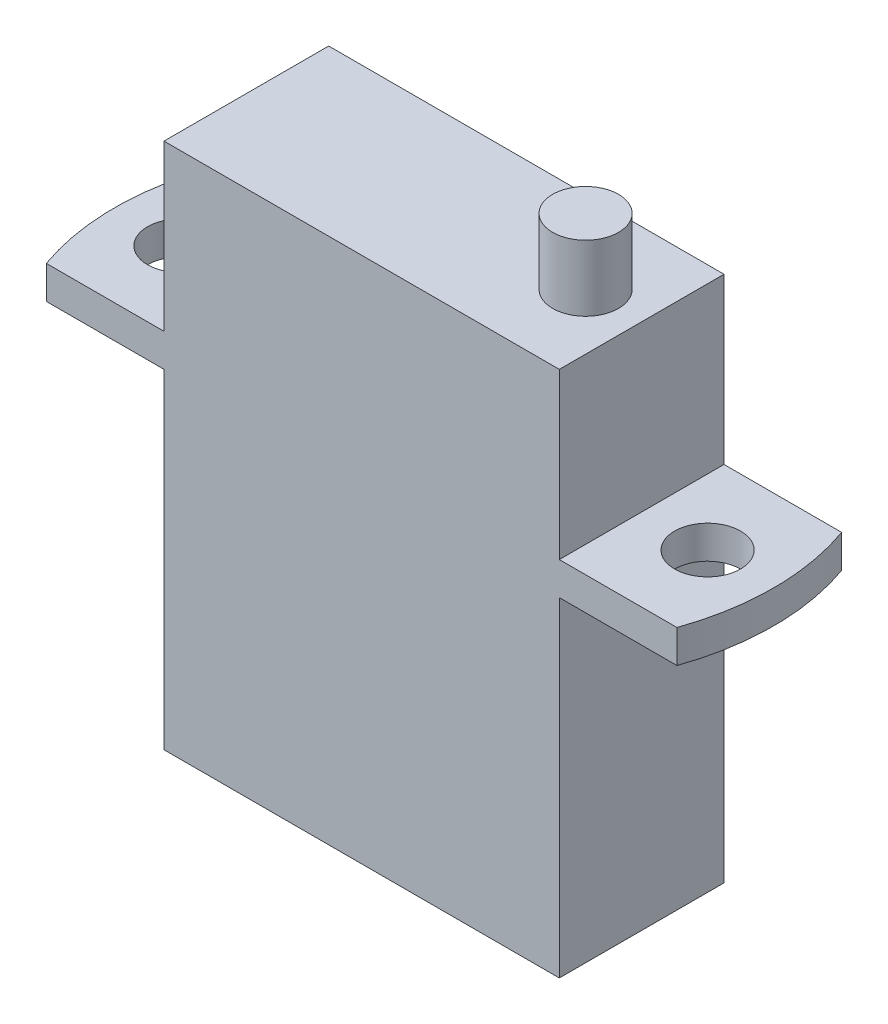
ISO-10303-21;
HEADER;
FILE_DESCRIPTION(('STEP AP214'),'2;1');
FILE_NAME('part.step','',(''),(''),'','','');
FILE_SCHEMA(('AUTOMOTIVE_DESIGN { 1 0 10303 214 1 1 1 1 }'));
ENDSEC;
DATA;
#1=APPLICATION_CONTEXT('core data for automotive mechanical design processes');
#2=APPLICATION_PROTOCOL_DEFINITION('international standard','automotive_design',2000,#1);
#3=PRODUCT_CONTEXT('',#1,'mechanical');
#4=PRODUCT('Part','Part','',(#3));
#5=PRODUCT_RELATED_PRODUCT_CATEGORY('part','',(#4));
#6=PRODUCT_DEFINITION_FORMATION('','',#4);
#7=PRODUCT_DEFINITION_CONTEXT('part definition',#1,'design');
#8=PRODUCT_DEFINITION('design','',#6,#7);
#9=PRODUCT_DEFINITION_SHAPE('','',#8);
#10=(LENGTH_UNIT() NAMED_UNIT(*) SI_UNIT(.MILLI.,.METRE.));
#11=(NAMED_UNIT(*) PLANE_ANGLE_UNIT() SI_UNIT($,.RADIAN.));
#12=(NAMED_UNIT(*) SI_UNIT($,.STERADIAN.) SOLID_ANGLE_UNIT());
#13=UNCERTAINTY_MEASURE_WITH_UNIT(LENGTH_MEASURE(1.E-05),#10,'distance_accuracy_value','');
#14=(GEOMETRIC_REPRESENTATION_CONTEXT(3) GLOBAL_UNCERTAINTY_ASSIGNED_CONTEXT((#13)) GLOBAL_UNIT_ASSIGNED_CONTEXT((#10,
#11,#12)) REPRESENTATION_CONTEXT('',''));
#15=CARTESIAN_POINT('',(0.,0.,0.));
#16=DIRECTION('',(0.,0.,1.));
#17=DIRECTION('',(1.,0.,0.));
#18=AXIS2_PLACEMENT_3D('',#15,#16,#17);
#19=CARTESIAN_POINT('',(0.,6.,0.));
#20=DIRECTION('',(0.,1.,0.));
#21=DIRECTION('',(0.,0.,1.));
#22=AXIS2_PLACEMENT_3D('',#19,#20,#21);
#23=PLANE('',#22);
#24=DIRECTION('',(1.,0.,0.));
#25=VECTOR('',#24,1.);
#26=CARTESIAN_POINT('',(-6.,6.,2.5));
#27=LINE('',#26,#25);
#28=CARTESIAN_POINT('',(-6.,6.,2.5));
#29=VERTEX_POINT('',#28);
#30=CARTESIAN_POINT('',(6.,6.,2.5));
#31=VERTEX_POINT('',#30);
#32=EDGE_CURVE('E136',#29,#31,#27,.T.);
#33=ORIENTED_EDGE('',*,*,#32,.T.);
#34=DIRECTION('',(0.,0.,-1.));
#35=VECTOR('',#34,1.);
#36=CARTESIAN_POINT('',(6.,6.,2.5));
#37=LINE('',#36,#35);
#38=CARTESIAN_POINT('',(6.,6.,-2.5));
#39=VERTEX_POINT('',#38);
#40=EDGE_CURVE('E126',#31,#39,#37,.T.);
#41=ORIENTED_EDGE('',*,*,#40,.T.);
#42=DIRECTION('',(-1.,0.,0.));
#43=VECTOR('',#42,1.);
#44=CARTESIAN_POINT('',(6.,6.,-2.5));
#45=LINE('',#44,#43);
#46=CARTESIAN_POINT('',(-6.,6.,-2.5));
#47=VERTEX_POINT('',#46);
#48=EDGE_CURVE('E135',#39,#47,#45,.T.);
#49=ORIENTED_EDGE('',*,*,#48,.T.);
#50=DIRECTION('',(0.,0.,1.));
#51=VECTOR('',#50,1.);
#52=CARTESIAN_POINT('',(-6.,6.,-2.5));
#53=LINE('',#52,#51);
#54=EDGE_CURVE('E141',#47,#29,#53,.T.);
#55=ORIENTED_EDGE('',*,*,#54,.T.);
#56=EDGE_LOOP('',(#33,#41,#49,#55));
#57=FACE_BOUND('',#56,.T.);
#58=CARTESIAN_POINT('',(4.29775761705287,6.,0.));
#59=DIRECTION('',(0.,1.,0.));
#60=DIRECTION('',(0.,0.,1.));
#61=AXIS2_PLACEMENT_3D('',#58,#59,#60);
#62=CIRCLE('',#61,1.);
#63=CARTESIAN_POINT('',(4.29775761705287,6.,1.));
#64=VERTEX_POINT('',#63);
#65=EDGE_CURVE('E509',#64,#64,#62,.T.);
#66=ORIENTED_EDGE('',*,*,#65,.F.);
#67=EDGE_LOOP('',(#66));
#68=FACE_BOUND('',#67,.T.);
#69=ADVANCED_FACE('F35',(#57,#68),#23,.T.);
#70=CARTESIAN_POINT('',(0.,1.,0.));
#71=DIRECTION('',(0.,1.,0.));
#72=DIRECTION('',(0.,0.,1.));
#73=AXIS2_PLACEMENT_3D('',#70,#71,#72);
#74=PLANE('',#73);
#75=DIRECTION('',(0.,0.,1.));
#76=VECTOR('',#75,1.);
#77=CARTESIAN_POINT('',(-6.,1.,-2.5));
#78=LINE('',#77,#76);
#79=CARTESIAN_POINT('',(-6.,1.,-2.5));
#80=VERTEX_POINT('',#79);
#81=CARTESIAN_POINT('',(-6.,1.,2.5));
#82=VERTEX_POINT('',#81);
#83=EDGE_CURVE('E52',#80,#82,#78,.T.);
#84=ORIENTED_EDGE('',*,*,#83,.F.);
#85=DIRECTION('',(1.,0.,0.));
#86=VECTOR('',#85,1.);
#87=CARTESIAN_POINT('',(0.,1.,-2.5));
#88=LINE('',#87,#86);
#89=CARTESIAN_POINT('',(-9.57106775270161,1.,-2.5));
#90=VERTEX_POINT('',#89);
#91=EDGE_CURVE('E261',#90,#80,#88,.T.);
#92=ORIENTED_EDGE('',*,*,#91,.F.);
#93=CARTESIAN_POINT('',(-2.5,1.,1.67340676413864E-07));
#94=DIRECTION('',(0.,1.,0.));
#95=DIRECTION('',(0.,0.,1.));
#96=AXIS2_PLACEMENT_3D('',#93,#94,#95);
#97=CIRCLE('',#96,7.5);
#98=CARTESIAN_POINT('',(-9.57106787102934,1.,2.5));
#99=VERTEX_POINT('',#98);
#100=EDGE_CURVE('E259',#99,#90,#97,.F.);
#101=ORIENTED_EDGE('',*,*,#100,.F.);
#102=DIRECTION('',(1.,0.,0.));
#103=VECTOR('',#102,1.);
#104=CARTESIAN_POINT('',(0.,1.,2.5));
#105=LINE('',#104,#103);
#106=EDGE_CURVE('E182',#99,#82,#105,.T.);
#107=ORIENTED_EDGE('',*,*,#106,.T.);
#108=EDGE_LOOP('',(#84,#92,#101,#107));
#109=FACE_BOUND('',#108,.T.);
#110=CARTESIAN_POINT('',(-8.,1.,5.35490164524363E-07));
#111=DIRECTION('',(0.,1.,0.));
#112=DIRECTION('',(0.,0.,1.));
#113=AXIS2_PLACEMENT_3D('',#110,#111,#112);
#114=CIRCLE('',#113,1.);
#115=CARTESIAN_POINT('',(-8.,1.,1.00000053549016));
#116=VERTEX_POINT('',#115);
#117=EDGE_CURVE('E245',#116,#116,#114,.F.);
#118=ORIENTED_EDGE('',*,*,#117,.T.);
#119=EDGE_LOOP('',(#118));
#120=FACE_BOUND('',#119,.T.);
#121=ADVANCED_FACE('F300',(#109,#120),#74,.T.);
#122=CARTESIAN_POINT('',(-6.,-10.,2.5));
#123=DIRECTION('',(-1.,0.,0.));
#124=DIRECTION('',(0.,0.,1.));
#125=AXIS2_PLACEMENT_3D('',#122,#123,#124);
#126=PLANE('',#125);
#127=DIRECTION('',(0.,0.,1.));
#128=VECTOR('',#127,1.);
#129=CARTESIAN_POINT('',(-6.,0.,2.5));
#130=LINE('',#129,#128);
#131=CARTESIAN_POINT('',(-6.,0.,-2.5));
#132=VERTEX_POINT('',#131);
#133=CARTESIAN_POINT('',(-6.,0.,2.5));
#134=VERTEX_POINT('',#133);
#135=EDGE_CURVE('E186',#132,#134,#130,.T.);
#136=ORIENTED_EDGE('',*,*,#135,.F.);
#137=DIRECTION('',(0.,1.,0.));
#138=VECTOR('',#137,1.);
#139=CARTESIAN_POINT('',(-6.,-10.,-2.5));
#140=LINE('',#139,#138);
#141=CARTESIAN_POINT('',(-6.,-10.,-2.5));
#142=VERTEX_POINT('',#141);
#143=EDGE_CURVE('E11',#142,#132,#140,.T.);
#144=ORIENTED_EDGE('',*,*,#143,.F.);
#145=DIRECTION('',(0.,0.,1.));
#146=VECTOR('',#145,1.);
#147=CARTESIAN_POINT('',(-6.,-10.,2.5));
#148=LINE('',#147,#146);
#149=CARTESIAN_POINT('',(-6.,-10.,2.5));
#150=VERTEX_POINT('',#149);
#151=EDGE_CURVE('E203',#142,#150,#148,.T.);
#152=ORIENTED_EDGE('',*,*,#151,.T.);
#153=DIRECTION('',(0.,1.,0.));
#154=VECTOR('',#153,1.);
#155=CARTESIAN_POINT('',(-6.,-10.,2.5));
#156=LINE('',#155,#154);
#157=EDGE_CURVE('E209',#150,#134,#156,.T.);
#158=ORIENTED_EDGE('',*,*,#157,.T.);
#159=EDGE_LOOP('',(#136,#144,#152,#158));
#160=FACE_BOUND('',#159,.T.);
#161=ADVANCED_FACE('F37',(#160),#126,.T.);
#162=CARTESIAN_POINT('',(6.,-10.,-2.5));
#163=DIRECTION('',(0.,0.,-1.));
#164=DIRECTION('',(-1.,0.,0.));
#165=AXIS2_PLACEMENT_3D('',#162,#163,#164);
#166=PLANE('',#165);
#167=ORIENTED_EDGE('',*,*,#143,.T.);
#168=DIRECTION('',(1.,0.,0.));
#169=VECTOR('',#168,1.);
#170=CARTESIAN_POINT('',(0.,0.,-2.5));
#171=LINE('',#170,#169);
#172=CARTESIAN_POINT('',(-9.57106775270161,0.,-2.5));
#173=VERTEX_POINT('',#172);
#174=EDGE_CURVE('E229',#173,#132,#171,.T.);
#175=ORIENTED_EDGE('',*,*,#174,.F.);
#176=DIRECTION('',(0.,-1.,0.));
#177=VECTOR('',#176,1.);
#178=CARTESIAN_POINT('',(-9.57106775270161,1.,-2.5));
#179=LINE('',#178,#177);
#180=EDGE_CURVE('E244',#90,#173,#179,.T.);
#181=ORIENTED_EDGE('',*,*,#180,.F.);
#182=ORIENTED_EDGE('',*,*,#91,.T.);
#183=DIRECTION('',(0.,-1.,0.));
#184=VECTOR('',#183,1.);
#185=CARTESIAN_POINT('',(-6.,6.,-2.5));
#186=LINE('',#185,#184);
#187=EDGE_CURVE('E154',#47,#80,#186,.T.);
#188=ORIENTED_EDGE('',*,*,#187,.F.);
#189=ORIENTED_EDGE('',*,*,#48,.F.);
#190=DIRECTION('',(0.,-1.,0.));
#191=VECTOR('',#190,1.);
#192=CARTESIAN_POINT('',(6.,6.,-2.5));
#193=LINE('',#192,#191);
#194=CARTESIAN_POINT('',(6.,1.,-2.5));
#195=VERTEX_POINT('',#194);
#196=EDGE_CURVE('E132',#39,#195,#193,.T.);
#197=ORIENTED_EDGE('',*,*,#196,.T.);
#198=CARTESIAN_POINT('',(9.57106775270161,1.,-2.5));
#199=VERTEX_POINT('',#198);
#200=EDGE_CURVE('E265',#195,#199,#88,.T.);
#201=ORIENTED_EDGE('',*,*,#200,.T.);
#202=DIRECTION('',(0.,-1.,0.));
#203=VECTOR('',#202,1.);
#204=CARTESIAN_POINT('',(9.57106775270161,1.,-2.5));
#205=LINE('',#204,#203);
#206=CARTESIAN_POINT('',(9.57106775270161,0.,-2.5));
#207=VERTEX_POINT('',#206);
#208=EDGE_CURVE('E247',#199,#207,#205,.T.);
#209=ORIENTED_EDGE('',*,*,#208,.T.);
#210=CARTESIAN_POINT('',(6.,0.,-2.5));
#211=VERTEX_POINT('',#210);
#212=EDGE_CURVE('E226',#211,#207,#171,.T.);
#213=ORIENTED_EDGE('',*,*,#212,.F.);
#214=DIRECTION('',(0.,1.,0.));
#215=VECTOR('',#214,1.);
#216=CARTESIAN_POINT('',(6.,-10.,-2.5));
#217=LINE('',#216,#215);
#218=CARTESIAN_POINT('',(6.,-10.,-2.5));
#219=VERTEX_POINT('',#218);
#220=EDGE_CURVE('E44',#219,#211,#217,.T.);
#221=ORIENTED_EDGE('',*,*,#220,.F.);
#222=DIRECTION('',(-1.,0.,0.));
#223=VECTOR('',#222,1.);
#224=CARTESIAN_POINT('',(6.,-10.,-2.5));
#225=LINE('',#224,#223);
#226=EDGE_CURVE('E197',#219,#142,#225,.T.);
#227=ORIENTED_EDGE('',*,*,#226,.T.);
#228=EDGE_LOOP('',(#167,#175,#181,#182,#188,#189,#197,#201,#209,#213,#221,#227));
#229=FACE_BOUND('',#228,.T.);
#230=ADVANCED_FACE('F279',(#229),#166,.T.);
#231=CARTESIAN_POINT('',(6.,-10.,2.5));
#232=DIRECTION('',(1.,0.,0.));
#233=DIRECTION('',(0.,0.,-1.));
#234=AXIS2_PLACEMENT_3D('',#231,#232,#233);
#235=PLANE('',#234);
#236=DIRECTION('',(0.,0.,-1.));
#237=VECTOR('',#236,1.);
#238=CARTESIAN_POINT('',(6.,0.,2.5));
#239=LINE('',#238,#237);
#240=CARTESIAN_POINT('',(6.,0.,2.5));
#241=VERTEX_POINT('',#240);
#242=EDGE_CURVE('E190',#241,#211,#239,.T.);
#243=ORIENTED_EDGE('',*,*,#242,.F.);
#244=DIRECTION('',(0.,1.,0.));
#245=VECTOR('',#244,1.);
#246=CARTESIAN_POINT('',(6.,-10.,2.5));
#247=LINE('',#246,#245);
#248=CARTESIAN_POINT('',(6.,-10.,2.5));
#249=VERTEX_POINT('',#248);
#250=EDGE_CURVE('E205',#249,#241,#247,.T.);
#251=ORIENTED_EDGE('',*,*,#250,.F.);
#252=DIRECTION('',(0.,0.,-1.));
#253=VECTOR('',#252,1.);
#254=CARTESIAN_POINT('',(6.,-10.,2.5));
#255=LINE('',#254,#253);
#256=EDGE_CURVE('E215',#249,#219,#255,.T.);
#257=ORIENTED_EDGE('',*,*,#256,.T.);
#258=ORIENTED_EDGE('',*,*,#220,.T.);
#259=EDGE_LOOP('',(#243,#251,#257,#258));
#260=FACE_BOUND('',#259,.T.);
#261=ADVANCED_FACE('F284',(#260),#235,.T.);
#262=CARTESIAN_POINT('',(6.,-10.,2.5));
#263=DIRECTION('',(0.,0.,1.));
#264=DIRECTION('',(1.,0.,0.));
#265=AXIS2_PLACEMENT_3D('',#262,#263,#264);
#266=PLANE('',#265);
#267=ORIENTED_EDGE('',*,*,#250,.T.);
#268=DIRECTION('',(1.,0.,0.));
#269=VECTOR('',#268,1.);
#270=CARTESIAN_POINT('',(0.,0.,2.5));
#271=LINE('',#270,#269);
#272=CARTESIAN_POINT('',(9.57106787102934,0.,2.5));
#273=VERTEX_POINT('',#272);
#274=EDGE_CURVE('E152',#241,#273,#271,.T.);
#275=ORIENTED_EDGE('',*,*,#274,.T.);
#276=DIRECTION('',(0.,-1.,0.));
#277=VECTOR('',#276,1.);
#278=CARTESIAN_POINT('',(9.57106787102934,1.,2.5));
#279=LINE('',#278,#277);
#280=CARTESIAN_POINT('',(9.57106787102934,1.,2.5));
#281=VERTEX_POINT('',#280);
#282=EDGE_CURVE('E191',#281,#273,#279,.T.);
#283=ORIENTED_EDGE('',*,*,#282,.F.);
#284=CARTESIAN_POINT('',(6.,1.,2.5));
#285=VERTEX_POINT('',#284);
#286=EDGE_CURVE('E148',#285,#281,#105,.T.);
#287=ORIENTED_EDGE('',*,*,#286,.F.);
#288=DIRECTION('',(0.,-1.,0.));
#289=VECTOR('',#288,1.);
#290=CARTESIAN_POINT('',(6.,6.,2.5));
#291=LINE('',#290,#289);
#292=EDGE_CURVE('E130',#31,#285,#291,.T.);
#293=ORIENTED_EDGE('',*,*,#292,.F.);
#294=ORIENTED_EDGE('',*,*,#32,.F.);
#295=DIRECTION('',(0.,-1.,0.));
#296=VECTOR('',#295,1.);
#297=CARTESIAN_POINT('',(-6.,6.,2.5));
#298=LINE('',#297,#296);
#299=EDGE_CURVE('E163',#29,#82,#298,.T.);
#300=ORIENTED_EDGE('',*,*,#299,.T.);
#301=ORIENTED_EDGE('',*,*,#106,.F.);
#302=DIRECTION('',(0.,-1.,0.));
#303=VECTOR('',#302,1.);
#304=CARTESIAN_POINT('',(-9.57106787102934,1.,2.5));
#305=LINE('',#304,#303);
#306=CARTESIAN_POINT('',(-9.57106787102934,0.,2.5));
#307=VERTEX_POINT('',#306);
#308=EDGE_CURVE('E242',#99,#307,#305,.T.);
#309=ORIENTED_EDGE('',*,*,#308,.T.);
#310=EDGE_CURVE('E252',#307,#134,#271,.T.);
#311=ORIENTED_EDGE('',*,*,#310,.T.);
#312=ORIENTED_EDGE('',*,*,#157,.F.);
#313=DIRECTION('',(1.,0.,0.));
#314=VECTOR('',#313,1.);
#315=CARTESIAN_POINT('',(6.,-10.,2.5));
#316=LINE('',#315,#314);
#317=EDGE_CURVE('E219',#150,#249,#316,.T.);
#318=ORIENTED_EDGE('',*,*,#317,.T.);
#319=EDGE_LOOP('',(#267,#275,#283,#287,#293,#294,#300,#301,#309,#311,#312,#318));
#320=FACE_BOUND('',#319,.T.);
#321=ADVANCED_FACE('F146',(#320),#266,.T.);
#322=CARTESIAN_POINT('',(0.,-10.,0.));
#323=DIRECTION('',(0.,1.,0.));
#324=DIRECTION('',(0.,0.,1.));
#325=AXIS2_PLACEMENT_3D('',#322,#323,#324);
#326=PLANE('',#325);
#327=ORIENTED_EDGE('',*,*,#151,.F.);
#328=ORIENTED_EDGE('',*,*,#226,.F.);
#329=ORIENTED_EDGE('',*,*,#256,.F.);
#330=ORIENTED_EDGE('',*,*,#317,.F.);
#331=EDGE_LOOP('',(#327,#328,#329,#330));
#332=FACE_BOUND('',#331,.T.);
#333=ADVANCED_FACE('F288',(#332),#326,.F.);
#334=CARTESIAN_POINT('',(0.,0.,0.));
#335=DIRECTION('',(0.,1.,0.));
#336=DIRECTION('',(0.,0.,1.));
#337=AXIS2_PLACEMENT_3D('',#334,#335,#336);
#338=PLANE('',#337);
#339=CARTESIAN_POINT('',(-8.,0.,5.35490164524363E-07));
#340=DIRECTION('',(0.,1.,0.));
#341=DIRECTION('',(0.,0.,1.));
#342=AXIS2_PLACEMENT_3D('',#339,#340,#341);
#343=CIRCLE('',#342,1.);
#344=CARTESIAN_POINT('',(-8.,0.,1.00000053549016));
#345=VERTEX_POINT('',#344);
#346=EDGE_CURVE('E173',#345,#345,#343,.F.);
#347=ORIENTED_EDGE('',*,*,#346,.F.);
#348=EDGE_LOOP('',(#347));
#349=FACE_BOUND('',#348,.T.);
#350=ORIENTED_EDGE('',*,*,#174,.T.);
#351=ORIENTED_EDGE('',*,*,#135,.T.);
#352=ORIENTED_EDGE('',*,*,#310,.F.);
#353=CARTESIAN_POINT('',(-2.5,0.,1.67340676413864E-07));
#354=DIRECTION('',(0.,1.,0.));
#355=DIRECTION('',(0.,0.,1.));
#356=AXIS2_PLACEMENT_3D('',#353,#354,#355);
#357=CIRCLE('',#356,7.5);
#358=EDGE_CURVE('E236',#307,#173,#357,.F.);
#359=ORIENTED_EDGE('',*,*,#358,.T.);
#360=EDGE_LOOP('',(#350,#351,#352,#359));
#361=FACE_BOUND('',#360,.T.);
#362=ADVANCED_FACE('F294',(#349,#361),#338,.F.);
#363=CARTESIAN_POINT('',(8.,0.,5.35490164524363E-07));
#364=DIRECTION('',(0.,1.,0.));
#365=DIRECTION('',(0.,0.,1.));
#366=AXIS2_PLACEMENT_3D('',#363,#364,#365);
#367=CIRCLE('',#366,1.);
#368=CARTESIAN_POINT('',(8.,0.,1.00000053549017));
#369=VERTEX_POINT('',#368);
#370=EDGE_CURVE('E149',#369,#369,#367,.T.);
#371=ORIENTED_EDGE('',*,*,#370,.T.);
#372=EDGE_LOOP('',(#371));
#373=FACE_BOUND('',#372,.T.);
#374=ORIENTED_EDGE('',*,*,#274,.F.);
#375=ORIENTED_EDGE('',*,*,#242,.T.);
#376=ORIENTED_EDGE('',*,*,#212,.T.);
#377=CARTESIAN_POINT('',(2.5,0.,1.67340676413864E-07));
#378=DIRECTION('',(0.,1.,0.));
#379=DIRECTION('',(0.,0.,1.));
#380=AXIS2_PLACEMENT_3D('',#377,#378,#379);
#381=CIRCLE('',#380,7.5);
#382=EDGE_CURVE('E230',#273,#207,#381,.T.);
#383=ORIENTED_EDGE('',*,*,#382,.F.);
#384=EDGE_LOOP('',(#374,#375,#376,#383));
#385=FACE_BOUND('',#384,.T.);
#386=ADVANCED_FACE('F282',(#373,#385),#338,.F.);
#387=CARTESIAN_POINT('',(2.5,1.,1.67340676413864E-07));
#388=DIRECTION('',(0.,-1.,0.));
#389=DIRECTION('',(0.,0.,-1.));
#390=AXIS2_PLACEMENT_3D('',#387,#388,#389);
#391=CYLINDRICAL_SURFACE('',#390,7.5);
#392=ORIENTED_EDGE('',*,*,#382,.T.);
#393=ORIENTED_EDGE('',*,*,#208,.F.);
#394=CARTESIAN_POINT('',(2.5,1.,1.67340676413864E-07));
#395=DIRECTION('',(0.,1.,0.));
#396=DIRECTION('',(0.,0.,1.));
#397=AXIS2_PLACEMENT_3D('',#394,#395,#396);
#398=CIRCLE('',#397,7.5);
#399=EDGE_CURVE('E176',#281,#199,#398,.T.);
#400=ORIENTED_EDGE('',*,*,#399,.F.);
#401=ORIENTED_EDGE('',*,*,#282,.T.);
#402=EDGE_LOOP('',(#392,#393,#400,#401));
#403=FACE_BOUND('',#402,.T.);
#404=ADVANCED_FACE('F276',(#403),#391,.T.);
#405=CARTESIAN_POINT('',(-2.5,1.,1.67340676413864E-07));
#406=DIRECTION('',(0.,-1.,0.));
#407=DIRECTION('',(0.,0.,-1.));
#408=AXIS2_PLACEMENT_3D('',#405,#406,#407);
#409=CYLINDRICAL_SURFACE('',#408,7.5);
#410=ORIENTED_EDGE('',*,*,#358,.F.);
#411=ORIENTED_EDGE('',*,*,#308,.F.);
#412=ORIENTED_EDGE('',*,*,#100,.T.);
#413=ORIENTED_EDGE('',*,*,#180,.T.);
#414=EDGE_LOOP('',(#410,#411,#412,#413));
#415=FACE_BOUND('',#414,.T.);
#416=ADVANCED_FACE('F296',(#415),#409,.T.);
#417=CARTESIAN_POINT('',(8.,1.,5.35490164524363E-07));
#418=DIRECTION('',(0.,-1.,0.));
#419=DIRECTION('',(0.,0.,-1.));
#420=AXIS2_PLACEMENT_3D('',#417,#418,#419);
#421=CYLINDRICAL_SURFACE('',#420,1.);
#422=CARTESIAN_POINT('',(8.,1.,5.35490164524363E-07));
#423=DIRECTION('',(0.,1.,0.));
#424=DIRECTION('',(0.,0.,1.));
#425=AXIS2_PLACEMENT_3D('',#422,#423,#424);
#426=CIRCLE('',#425,1.);
#427=CARTESIAN_POINT('',(8.,1.,1.00000053549017));
#428=VERTEX_POINT('',#427);
#429=EDGE_CURVE('E170',#428,#428,#426,.T.);
#430=ORIENTED_EDGE('',*,*,#429,.T.);
#431=EDGE_LOOP('',(#430));
#432=FACE_BOUND('',#431,.T.);
#433=ORIENTED_EDGE('',*,*,#370,.F.);
#434=EDGE_LOOP('',(#433));
#435=FACE_BOUND('',#434,.T.);
#436=ADVANCED_FACE('F328',(#432,#435),#421,.F.);
#437=CARTESIAN_POINT('',(-8.,1.,5.35490164524363E-07));
#438=DIRECTION('',(0.,-1.,0.));
#439=DIRECTION('',(0.,0.,-1.));
#440=AXIS2_PLACEMENT_3D('',#437,#438,#439);
#441=CYLINDRICAL_SURFACE('',#440,1.);
#442=ORIENTED_EDGE('',*,*,#117,.F.);
#443=EDGE_LOOP('',(#442));
#444=FACE_BOUND('',#443,.T.);
#445=ORIENTED_EDGE('',*,*,#346,.T.);
#446=EDGE_LOOP('',(#445));
#447=FACE_BOUND('',#446,.T.);
#448=ADVANCED_FACE('F322',(#444,#447),#441,.F.);
#449=DIRECTION('',(0.,0.,-1.));
#450=VECTOR('',#449,1.);
#451=CARTESIAN_POINT('',(6.,1.,2.5));
#452=LINE('',#451,#450);
#453=EDGE_CURVE('E60',#285,#195,#452,.T.);
#454=ORIENTED_EDGE('',*,*,#453,.F.);
#455=ORIENTED_EDGE('',*,*,#286,.T.);
#456=ORIENTED_EDGE('',*,*,#399,.T.);
#457=ORIENTED_EDGE('',*,*,#200,.F.);
#458=EDGE_LOOP('',(#454,#455,#456,#457));
#459=FACE_BOUND('',#458,.T.);
#460=ORIENTED_EDGE('',*,*,#429,.F.);
#461=EDGE_LOOP('',(#460));
#462=FACE_BOUND('',#461,.T.);
#463=ADVANCED_FACE('F272',(#459,#462),#74,.T.);
#464=CARTESIAN_POINT('',(6.,6.,2.5));
#465=DIRECTION('',(-1.,0.,0.));
#466=DIRECTION('',(0.,0.,1.));
#467=AXIS2_PLACEMENT_3D('',#464,#465,#466);
#468=PLANE('',#467);
#469=ORIENTED_EDGE('',*,*,#453,.T.);
#470=ORIENTED_EDGE('',*,*,#196,.F.);
#471=ORIENTED_EDGE('',*,*,#40,.F.);
#472=ORIENTED_EDGE('',*,*,#292,.T.);
#473=EDGE_LOOP('',(#469,#470,#471,#472));
#474=FACE_BOUND('',#473,.T.);
#475=ADVANCED_FACE('F128',(#474),#468,.F.);
#476=CARTESIAN_POINT('',(-6.,6.,-2.5));
#477=DIRECTION('',(1.,0.,0.));
#478=DIRECTION('',(0.,0.,-1.));
#479=AXIS2_PLACEMENT_3D('',#476,#477,#478);
#480=PLANE('',#479);
#481=ORIENTED_EDGE('',*,*,#83,.T.);
#482=ORIENTED_EDGE('',*,*,#299,.F.);
#483=ORIENTED_EDGE('',*,*,#54,.F.);
#484=ORIENTED_EDGE('',*,*,#187,.T.);
#485=EDGE_LOOP('',(#481,#482,#483,#484));
#486=FACE_BOUND('',#485,.T.);
#487=ADVANCED_FACE('F315',(#486),#480,.F.);
#488=CARTESIAN_POINT('',(4.29775761705287,8.,0.));
#489=DIRECTION('',(0.,-1.,0.));
#490=DIRECTION('',(0.,0.,-1.));
#491=AXIS2_PLACEMENT_3D('',#488,#489,#490);
#492=CYLINDRICAL_SURFACE('',#491,1.);
#493=CARTESIAN_POINT('',(4.29775761705287,8.,0.));
#494=DIRECTION('',(0.,1.,0.));
#495=DIRECTION('',(0.,0.,1.));
#496=AXIS2_PLACEMENT_3D('',#493,#494,#495);
#497=CIRCLE('',#496,1.);
#498=CARTESIAN_POINT('',(4.29775761705287,8.,1.));
#499=VERTEX_POINT('',#498);
#500=EDGE_CURVE('E508',#499,#499,#497,.T.);
#501=ORIENTED_EDGE('',*,*,#500,.F.);
#502=EDGE_LOOP('',(#501));
#503=FACE_BOUND('',#502,.T.);
#504=ORIENTED_EDGE('',*,*,#65,.T.);
#505=EDGE_LOOP('',(#504));
#506=FACE_BOUND('',#505,.T.);
#507=ADVANCED_FACE('F313',(#503,#506),#492,.T.);
#508=CARTESIAN_POINT('',(4.29775761705287,8.,0.));
#509=DIRECTION('',(0.,1.,0.));
#510=DIRECTION('',(0.,0.,1.));
#511=AXIS2_PLACEMENT_3D('',#508,#509,#510);
#512=PLANE('',#511);
#513=ORIENTED_EDGE('',*,*,#500,.T.);
#514=EDGE_LOOP('',(#513));
#515=FACE_BOUND('',#514,.T.);
#516=ADVANCED_FACE('F395',(#515),#512,.T.);
#517=CLOSED_SHELL('',(#69,#121,#161,#230,#261,#321,#333,#362,#386,#404,#416,#436,#448,#463,#475,
#487,#507,#516));
#518=MANIFOLD_SOLID_BREP('B2',#517);
#519=ADVANCED_BREP_SHAPE_REPRESENTATION('',(#18,#518),#14);
#520=SHAPE_DEFINITION_REPRESENTATION(#9,#519);
ENDSEC;
END-ISO-10303-21;
